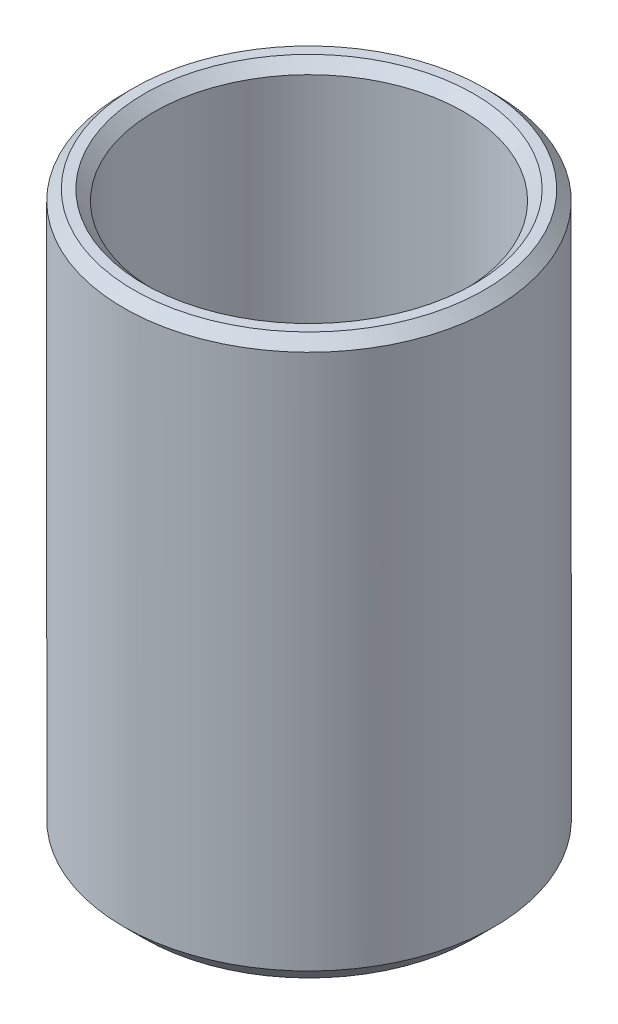
ISO-10303-21;
HEADER;
FILE_DESCRIPTION(('STEP AP214'),'2;1');
FILE_NAME('part.step','',(''),(''),'','','');
FILE_SCHEMA(('AUTOMOTIVE_DESIGN { 1 0 10303 214 1 1 1 1 }'));
ENDSEC;
DATA;
#1=APPLICATION_CONTEXT('core data for automotive mechanical design processes');
#2=APPLICATION_PROTOCOL_DEFINITION('international standard','automotive_design',2000,#1);
#3=PRODUCT_CONTEXT('',#1,'mechanical');
#4=PRODUCT('Part','Part','',(#3));
#5=PRODUCT_RELATED_PRODUCT_CATEGORY('part','',(#4));
#6=PRODUCT_DEFINITION_FORMATION('','',#4);
#7=PRODUCT_DEFINITION_CONTEXT('part definition',#1,'design');
#8=PRODUCT_DEFINITION('design','',#6,#7);
#9=PRODUCT_DEFINITION_SHAPE('','',#8);
#10=(LENGTH_UNIT() NAMED_UNIT(*) SI_UNIT(.MILLI.,.METRE.));
#11=(NAMED_UNIT(*) PLANE_ANGLE_UNIT() SI_UNIT($,.RADIAN.));
#12=(NAMED_UNIT(*) SI_UNIT($,.STERADIAN.) SOLID_ANGLE_UNIT());
#13=UNCERTAINTY_MEASURE_WITH_UNIT(LENGTH_MEASURE(1.E-05),#10,'distance_accuracy_value','');
#14=(GEOMETRIC_REPRESENTATION_CONTEXT(3) GLOBAL_UNCERTAINTY_ASSIGNED_CONTEXT((#13)) GLOBAL_UNIT_ASSIGNED_CONTEXT((#10,
#11,#12)) REPRESENTATION_CONTEXT('',''));
#15=CARTESIAN_POINT('',(0.,0.,0.));
#16=DIRECTION('',(0.,0.,1.));
#17=DIRECTION('',(1.,0.,0.));
#18=AXIS2_PLACEMENT_3D('',#15,#16,#17);
#19=CARTESIAN_POINT('',(0.,0.,0.));
#20=DIRECTION('',(0.,1.,0.));
#21=DIRECTION('',(0.,0.,1.));
#22=AXIS2_PLACEMENT_3D('',#19,#20,#21);
#23=PLANE('',#22);
#24=CARTESIAN_POINT('',(0.,0.,0.));
#25=DIRECTION('',(0.,1.,0.));
#26=DIRECTION('',(0.,0.,1.));
#27=AXIS2_PLACEMENT_3D('',#24,#25,#26);
#28=CIRCLE('',#27,16.);
#29=CARTESIAN_POINT('',(0.,0.,16.));
#30=VERTEX_POINT('',#29);
#31=EDGE_CURVE('E63',#30,#30,#28,.F.);
#32=ORIENTED_EDGE('',*,*,#31,.T.);
#33=EDGE_LOOP('',(#32));
#34=FACE_BOUND('',#33,.T.);
#35=ADVANCED_FACE('F34',(#34),#23,.F.);
#36=CARTESIAN_POINT('',(0.,3.,0.));
#37=DIRECTION('',(0.,-1.,0.));
#38=DIRECTION('',(0.,0.,-1.));
#39=AXIS2_PLACEMENT_3D('',#36,#37,#38);
#40=CYLINDRICAL_SURFACE('',#39,18.);
#41=CARTESIAN_POINT('',(0.,54.,0.));
#42=DIRECTION('',(0.,-1.,0.));
#43=DIRECTION('',(0.,0.,-1.));
#44=AXIS2_PLACEMENT_3D('',#41,#42,#43);
#45=CIRCLE('',#44,18.);
#46=CARTESIAN_POINT('',(0.,54.,-18.));
#47=VERTEX_POINT('',#46);
#48=EDGE_CURVE('E57',#47,#47,#45,.T.);
#49=ORIENTED_EDGE('',*,*,#48,.T.);
#50=EDGE_LOOP('',(#49));
#51=FACE_BOUND('',#50,.T.);
#52=CARTESIAN_POINT('',(0.,2.,0.));
#53=DIRECTION('',(0.,1.,0.));
#54=DIRECTION('',(0.,0.,1.));
#55=AXIS2_PLACEMENT_3D('',#52,#53,#54);
#56=CIRCLE('',#55,18.);
#57=CARTESIAN_POINT('',(0.,2.,18.));
#58=VERTEX_POINT('',#57);
#59=EDGE_CURVE('E60',#58,#58,#56,.T.);
#60=ORIENTED_EDGE('',*,*,#59,.T.);
#61=EDGE_LOOP('',(#60));
#62=FACE_BOUND('',#61,.T.);
#63=ADVANCED_FACE('F86',(#51,#62),#40,.T.);
#64=CARTESIAN_POINT('',(-18.,55.,0.));
#65=DIRECTION('',(0.,-1.,0.));
#66=DIRECTION('',(0.,0.,-1.));
#67=AXIS2_PLACEMENT_3D('',#64,#65,#66);
#68=PLANE('',#67);
#69=CARTESIAN_POINT('',(0.,55.,0.));
#70=DIRECTION('',(0.,-1.,0.));
#71=DIRECTION('',(0.,0.,-1.));
#72=AXIS2_PLACEMENT_3D('',#69,#70,#71);
#73=CIRCLE('',#72,17.);
#74=CARTESIAN_POINT('',(0.,55.,-17.));
#75=VERTEX_POINT('',#74);
#76=EDGE_CURVE('E49',#75,#75,#73,.F.);
#77=ORIENTED_EDGE('',*,*,#76,.T.);
#78=EDGE_LOOP('',(#77));
#79=FACE_BOUND('',#78,.T.);
#80=CARTESIAN_POINT('',(0.,55.,0.));
#81=DIRECTION('',(0.,-1.,0.));
#82=DIRECTION('',(0.,0.,-1.));
#83=AXIS2_PLACEMENT_3D('',#80,#81,#82);
#84=CIRCLE('',#83,16.);
#85=CARTESIAN_POINT('',(0.,55.,-16.));
#86=VERTEX_POINT('',#85);
#87=EDGE_CURVE('E54',#86,#86,#84,.T.);
#88=ORIENTED_EDGE('',*,*,#87,.T.);
#89=EDGE_LOOP('',(#88));
#90=FACE_BOUND('',#89,.T.);
#91=ADVANCED_FACE('F90',(#79,#90),#68,.F.);
#92=CARTESIAN_POINT('',(0.,3.,0.));
#93=DIRECTION('',(0.,-1.,0.));
#94=DIRECTION('',(0.,0.,-1.));
#95=AXIS2_PLACEMENT_3D('',#92,#93,#94);
#96=CYLINDRICAL_SURFACE('',#95,15.);
#97=CARTESIAN_POINT('',(0.,4.,0.));
#98=DIRECTION('',(0.,-1.,0.));
#99=DIRECTION('',(0.,0.,-1.));
#100=AXIS2_PLACEMENT_3D('',#97,#98,#99);
#101=CIRCLE('',#100,15.);
#102=CARTESIAN_POINT('',(0.,4.,-15.));
#103=VERTEX_POINT('',#102);
#104=EDGE_CURVE('E41',#103,#103,#101,.T.);
#105=ORIENTED_EDGE('',*,*,#104,.T.);
#106=EDGE_LOOP('',(#105));
#107=FACE_BOUND('',#106,.T.);
#108=CARTESIAN_POINT('',(0.,54.,0.));
#109=DIRECTION('',(0.,-1.,0.));
#110=DIRECTION('',(0.,0.,-1.));
#111=AXIS2_PLACEMENT_3D('',#108,#109,#110);
#112=CIRCLE('',#111,15.);
#113=CARTESIAN_POINT('',(0.,54.,-15.));
#114=VERTEX_POINT('',#113);
#115=EDGE_CURVE('E45',#114,#114,#112,.F.);
#116=ORIENTED_EDGE('',*,*,#115,.T.);
#117=EDGE_LOOP('',(#116));
#118=FACE_BOUND('',#117,.T.);
#119=ADVANCED_FACE('F81',(#107,#118),#96,.F.);
#120=CARTESIAN_POINT('',(-15.,3.,0.));
#121=DIRECTION('',(0.,-1.,0.));
#122=DIRECTION('',(0.,0.,-1.));
#123=AXIS2_PLACEMENT_3D('',#120,#121,#122);
#124=PLANE('',#123);
#125=CARTESIAN_POINT('',(0.,3.,0.));
#126=DIRECTION('',(0.,-1.,0.));
#127=DIRECTION('',(0.,0.,-1.));
#128=AXIS2_PLACEMENT_3D('',#125,#126,#127);
#129=CIRCLE('',#128,14.);
#130=CARTESIAN_POINT('',(0.,3.,-14.));
#131=VERTEX_POINT('',#130);
#132=EDGE_CURVE('E10',#131,#131,#129,.F.);
#133=ORIENTED_EDGE('',*,*,#132,.T.);
#134=EDGE_LOOP('',(#133));
#135=FACE_BOUND('',#134,.T.);
#136=ADVANCED_FACE('F71',(#135),#124,.F.);
#137=CARTESIAN_POINT('',(0.,0.,0.));
#138=DIRECTION('',(0.,1.,0.));
#139=DIRECTION('',(0.,0.,1.));
#140=AXIS2_PLACEMENT_3D('',#137,#138,#139);
#141=CONICAL_SURFACE('',#140,16.,0.785398163397447);
#142=ORIENTED_EDGE('',*,*,#59,.F.);
#143=EDGE_LOOP('',(#142));
#144=FACE_BOUND('',#143,.T.);
#145=ORIENTED_EDGE('',*,*,#31,.F.);
#146=EDGE_LOOP('',(#145));
#147=FACE_BOUND('',#146,.T.);
#148=ADVANCED_FACE('F68',(#144,#147),#141,.T.);
#149=CARTESIAN_POINT('',(0.,54.,0.));
#150=DIRECTION('',(0.,-1.,0.));
#151=DIRECTION('',(0.,0.,-1.));
#152=AXIS2_PLACEMENT_3D('',#149,#150,#151);
#153=CONICAL_SURFACE('',#152,18.,0.785398163397457);
#154=ORIENTED_EDGE('',*,*,#76,.F.);
#155=EDGE_LOOP('',(#154));
#156=FACE_BOUND('',#155,.T.);
#157=ORIENTED_EDGE('',*,*,#48,.F.);
#158=EDGE_LOOP('',(#157));
#159=FACE_BOUND('',#158,.T.);
#160=ADVANCED_FACE('F70',(#156,#159),#153,.T.);
#161=CARTESIAN_POINT('',(0.,55.,0.));
#162=DIRECTION('',(0.,1.,0.));
#163=DIRECTION('',(0.,0.,1.));
#164=AXIS2_PLACEMENT_3D('',#161,#162,#163);
#165=CONICAL_SURFACE('',#164,16.,0.785398163397447);
#166=ORIENTED_EDGE('',*,*,#115,.F.);
#167=EDGE_LOOP('',(#166));
#168=FACE_BOUND('',#167,.T.);
#169=ORIENTED_EDGE('',*,*,#87,.F.);
#170=EDGE_LOOP('',(#169));
#171=FACE_BOUND('',#170,.T.);
#172=ADVANCED_FACE('F78',(#168,#171),#165,.F.);
#173=CARTESIAN_POINT('',(0.,4.,0.));
#174=DIRECTION('',(0.,1.,0.));
#175=DIRECTION('',(0.,0.,1.));
#176=AXIS2_PLACEMENT_3D('',#173,#174,#175);
#177=CONICAL_SURFACE('',#176,15.,0.785398163397441);
#178=ORIENTED_EDGE('',*,*,#132,.F.);
#179=EDGE_LOOP('',(#178));
#180=FACE_BOUND('',#179,.T.);
#181=ORIENTED_EDGE('',*,*,#104,.F.);
#182=EDGE_LOOP('',(#181));
#183=FACE_BOUND('',#182,.T.);
#184=ADVANCED_FACE('F36',(#180,#183),#177,.F.);
#185=CLOSED_SHELL('',(#35,#63,#91,#119,#136,#148,#160,#172,#184));
#186=MANIFOLD_SOLID_BREP('B2',#185);
#187=ADVANCED_BREP_SHAPE_REPRESENTATION('',(#18,#186),#14);
#188=SHAPE_DEFINITION_REPRESENTATION(#9,#187);
ENDSEC;
END-ISO-10303-21;
